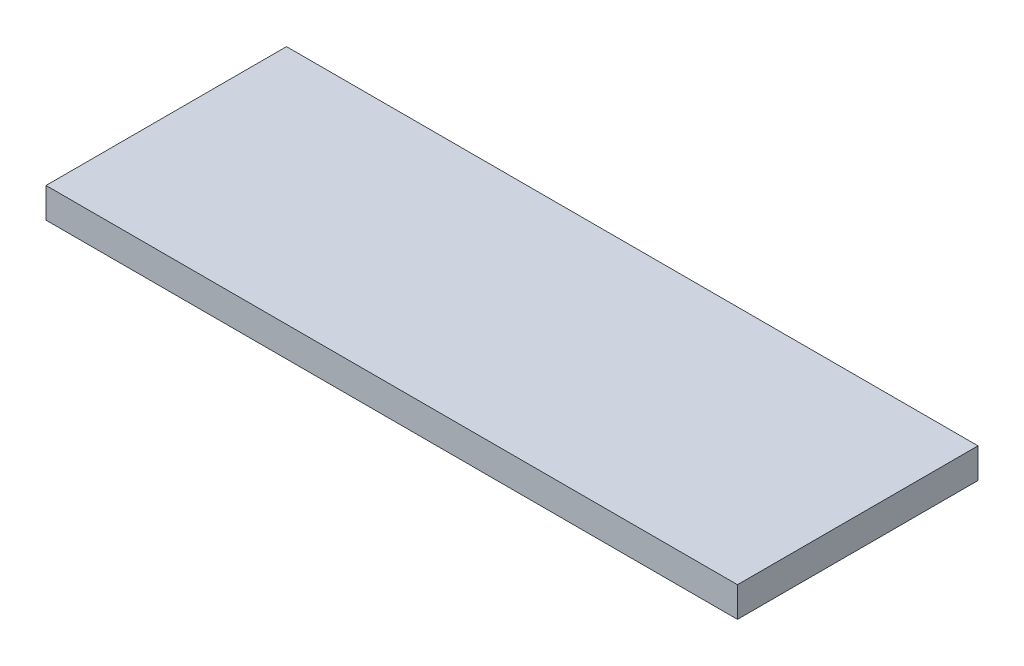
ISO-10303-21;
HEADER;
FILE_DESCRIPTION(('STEP AP214'),'2;1');
FILE_NAME('part.step','',(''),(''),'','','');
FILE_SCHEMA(('AUTOMOTIVE_DESIGN { 1 0 10303 214 1 1 1 1 }'));
ENDSEC;
DATA;
#1=APPLICATION_CONTEXT('core data for automotive mechanical design processes');
#2=APPLICATION_PROTOCOL_DEFINITION('international standard','automotive_design',2000,#1);
#3=PRODUCT_CONTEXT('',#1,'mechanical');
#4=PRODUCT('Part','Part','',(#3));
#5=PRODUCT_RELATED_PRODUCT_CATEGORY('part','',(#4));
#6=PRODUCT_DEFINITION_FORMATION('','',#4);
#7=PRODUCT_DEFINITION_CONTEXT('part definition',#1,'design');
#8=PRODUCT_DEFINITION('design','',#6,#7);
#9=PRODUCT_DEFINITION_SHAPE('','',#8);
#10=(LENGTH_UNIT() NAMED_UNIT(*) SI_UNIT(.MILLI.,.METRE.));
#11=(NAMED_UNIT(*) PLANE_ANGLE_UNIT() SI_UNIT($,.RADIAN.));
#12=(NAMED_UNIT(*) SI_UNIT($,.STERADIAN.) SOLID_ANGLE_UNIT());
#13=UNCERTAINTY_MEASURE_WITH_UNIT(LENGTH_MEASURE(1.E-05),#10,'distance_accuracy_value','');
#14=(GEOMETRIC_REPRESENTATION_CONTEXT(3) GLOBAL_UNCERTAINTY_ASSIGNED_CONTEXT((#13)) GLOBAL_UNIT_ASSIGNED_CONTEXT((#10,
#11,#12)) REPRESENTATION_CONTEXT('',''));
#15=CARTESIAN_POINT('',(0.,0.,0.));
#16=DIRECTION('',(0.,0.,1.));
#17=DIRECTION('',(1.,0.,0.));
#18=AXIS2_PLACEMENT_3D('',#15,#16,#17);
#19=CARTESIAN_POINT('',(-57.5,5.,-20.));
#20=DIRECTION('',(1.,0.,0.));
#21=DIRECTION('',(0.,0.,-1.));
#22=AXIS2_PLACEMENT_3D('',#19,#20,#21);
#23=PLANE('',#22);
#24=DIRECTION('',(0.,0.,1.));
#25=VECTOR('',#24,1.);
#26=CARTESIAN_POINT('',(-57.5,0.,-20.));
#27=LINE('',#26,#25);
#28=CARTESIAN_POINT('',(-57.5,0.,-20.));
#29=VERTEX_POINT('',#28);
#30=CARTESIAN_POINT('',(-57.5,0.,20.));
#31=VERTEX_POINT('',#30);
#32=EDGE_CURVE('E107',#29,#31,#27,.T.);
#33=ORIENTED_EDGE('',*,*,#32,.T.);
#34=DIRECTION('',(0.,-1.,0.));
#35=VECTOR('',#34,1.);
#36=CARTESIAN_POINT('',(-57.5,5.,20.));
#37=LINE('',#36,#35);
#38=CARTESIAN_POINT('',(-57.5,5.,20.));
#39=VERTEX_POINT('',#38);
#40=EDGE_CURVE('E11',#39,#31,#37,.T.);
#41=ORIENTED_EDGE('',*,*,#40,.F.);
#42=DIRECTION('',(0.,0.,1.));
#43=VECTOR('',#42,1.);
#44=CARTESIAN_POINT('',(-57.5,5.,-20.));
#45=LINE('',#44,#43);
#46=CARTESIAN_POINT('',(-57.5,5.,-20.));
#47=VERTEX_POINT('',#46);
#48=EDGE_CURVE('E91',#47,#39,#45,.T.);
#49=ORIENTED_EDGE('',*,*,#48,.F.);
#50=DIRECTION('',(0.,-1.,0.));
#51=VECTOR('',#50,1.);
#52=CARTESIAN_POINT('',(-57.5,5.,-20.));
#53=LINE('',#52,#51);
#54=EDGE_CURVE('E103',#47,#29,#53,.T.);
#55=ORIENTED_EDGE('',*,*,#54,.T.);
#56=EDGE_LOOP('',(#33,#41,#49,#55));
#57=FACE_BOUND('',#56,.T.);
#58=ADVANCED_FACE('F39',(#57),#23,.F.);
#59=CARTESIAN_POINT('',(-57.5,5.,20.));
#60=DIRECTION('',(0.,0.,-1.));
#61=DIRECTION('',(-1.,0.,0.));
#62=AXIS2_PLACEMENT_3D('',#59,#60,#61);
#63=PLANE('',#62);
#64=DIRECTION('',(1.,0.,0.));
#65=VECTOR('',#64,1.);
#66=CARTESIAN_POINT('',(-57.5,0.,20.));
#67=LINE('',#66,#65);
#68=CARTESIAN_POINT('',(57.5,0.,20.));
#69=VERTEX_POINT('',#68);
#70=EDGE_CURVE('E96',#31,#69,#67,.T.);
#71=ORIENTED_EDGE('',*,*,#70,.T.);
#72=DIRECTION('',(0.,-1.,0.));
#73=VECTOR('',#72,1.);
#74=CARTESIAN_POINT('',(57.5,5.,20.));
#75=LINE('',#74,#73);
#76=CARTESIAN_POINT('',(57.5,5.,20.));
#77=VERTEX_POINT('',#76);
#78=EDGE_CURVE('E48',#77,#69,#75,.T.);
#79=ORIENTED_EDGE('',*,*,#78,.F.);
#80=DIRECTION('',(1.,0.,0.));
#81=VECTOR('',#80,1.);
#82=CARTESIAN_POINT('',(-57.5,5.,20.));
#83=LINE('',#82,#81);
#84=EDGE_CURVE('E86',#39,#77,#83,.T.);
#85=ORIENTED_EDGE('',*,*,#84,.F.);
#86=ORIENTED_EDGE('',*,*,#40,.T.);
#87=EDGE_LOOP('',(#71,#79,#85,#86));
#88=FACE_BOUND('',#87,.T.);
#89=ADVANCED_FACE('F95',(#88),#63,.F.);
#90=CARTESIAN_POINT('',(57.5,5.,-20.));
#91=DIRECTION('',(-1.,0.,0.));
#92=DIRECTION('',(0.,0.,1.));
#93=AXIS2_PLACEMENT_3D('',#90,#91,#92);
#94=PLANE('',#93);
#95=DIRECTION('',(0.,0.,-1.));
#96=VECTOR('',#95,1.);
#97=CARTESIAN_POINT('',(57.5,0.,-20.));
#98=LINE('',#97,#96);
#99=CARTESIAN_POINT('',(57.5,0.,-20.));
#100=VERTEX_POINT('',#99);
#101=EDGE_CURVE('E73',#69,#100,#98,.T.);
#102=ORIENTED_EDGE('',*,*,#101,.T.);
#103=DIRECTION('',(0.,-1.,0.));
#104=VECTOR('',#103,1.);
#105=CARTESIAN_POINT('',(57.5,5.,-20.));
#106=LINE('',#105,#104);
#107=CARTESIAN_POINT('',(57.5,5.,-20.));
#108=VERTEX_POINT('',#107);
#109=EDGE_CURVE('E98',#108,#100,#106,.T.);
#110=ORIENTED_EDGE('',*,*,#109,.F.);
#111=DIRECTION('',(0.,0.,-1.));
#112=VECTOR('',#111,1.);
#113=CARTESIAN_POINT('',(57.5,5.,-20.));
#114=LINE('',#113,#112);
#115=EDGE_CURVE('E89',#77,#108,#114,.T.);
#116=ORIENTED_EDGE('',*,*,#115,.F.);
#117=ORIENTED_EDGE('',*,*,#78,.T.);
#118=EDGE_LOOP('',(#102,#110,#116,#117));
#119=FACE_BOUND('',#118,.T.);
#120=ADVANCED_FACE('F99',(#119),#94,.F.);
#121=CARTESIAN_POINT('',(-57.5,5.,-20.));
#122=DIRECTION('',(0.,0.,1.));
#123=DIRECTION('',(1.,0.,0.));
#124=AXIS2_PLACEMENT_3D('',#121,#122,#123);
#125=PLANE('',#124);
#126=DIRECTION('',(-1.,0.,0.));
#127=VECTOR('',#126,1.);
#128=CARTESIAN_POINT('',(-57.5,0.,-20.));
#129=LINE('',#128,#127);
#130=EDGE_CURVE('E79',#100,#29,#129,.T.);
#131=ORIENTED_EDGE('',*,*,#130,.T.);
#132=ORIENTED_EDGE('',*,*,#54,.F.);
#133=DIRECTION('',(-1.,0.,0.));
#134=VECTOR('',#133,1.);
#135=CARTESIAN_POINT('',(-57.5,5.,-20.));
#136=LINE('',#135,#134);
#137=EDGE_CURVE('E56',#108,#47,#136,.T.);
#138=ORIENTED_EDGE('',*,*,#137,.F.);
#139=ORIENTED_EDGE('',*,*,#109,.T.);
#140=EDGE_LOOP('',(#131,#132,#138,#139));
#141=FACE_BOUND('',#140,.T.);
#142=ADVANCED_FACE('F120',(#141),#125,.F.);
#143=CARTESIAN_POINT('',(0.,5.,0.));
#144=DIRECTION('',(0.,1.,0.));
#145=DIRECTION('',(0.,0.,1.));
#146=AXIS2_PLACEMENT_3D('',#143,#144,#145);
#147=PLANE('',#146);
#148=ORIENTED_EDGE('',*,*,#48,.T.);
#149=ORIENTED_EDGE('',*,*,#84,.T.);
#150=ORIENTED_EDGE('',*,*,#115,.T.);
#151=ORIENTED_EDGE('',*,*,#137,.T.);
#152=EDGE_LOOP('',(#148,#149,#150,#151));
#153=FACE_BOUND('',#152,.T.);
#154=ADVANCED_FACE('F87',(#153),#147,.T.);
#155=CARTESIAN_POINT('',(0.,0.,0.));
#156=DIRECTION('',(0.,1.,0.));
#157=DIRECTION('',(0.,0.,1.));
#158=AXIS2_PLACEMENT_3D('',#155,#156,#157);
#159=PLANE('',#158);
#160=ORIENTED_EDGE('',*,*,#32,.F.);
#161=ORIENTED_EDGE('',*,*,#130,.F.);
#162=ORIENTED_EDGE('',*,*,#101,.F.);
#163=ORIENTED_EDGE('',*,*,#70,.F.);
#164=EDGE_LOOP('',(#160,#161,#162,#163));
#165=FACE_BOUND('',#164,.T.);
#166=ADVANCED_FACE('F123',(#165),#159,.F.);
#167=CLOSED_SHELL('',(#58,#89,#120,#142,#154,#166));
#168=MANIFOLD_SOLID_BREP('B2',#167);
#169=ADVANCED_BREP_SHAPE_REPRESENTATION('',(#18,#168),#14);
#170=SHAPE_DEFINITION_REPRESENTATION(#9,#169);
ENDSEC;
END-ISO-10303-21;
